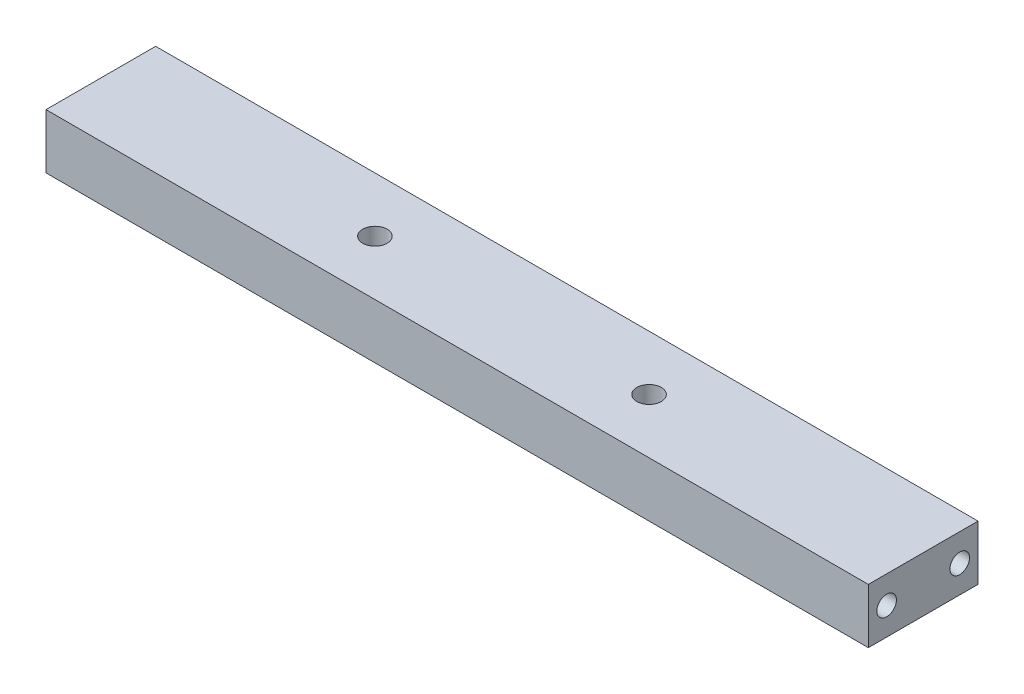
ISO-10303-21;
HEADER;
FILE_DESCRIPTION(('STEP AP214'),'2;1');
FILE_NAME('part.step','',(''),(''),'','','');
FILE_SCHEMA(('AUTOMOTIVE_DESIGN { 1 0 10303 214 1 1 1 1 }'));
ENDSEC;
DATA;
#1=APPLICATION_CONTEXT('core data for automotive mechanical design processes');
#2=APPLICATION_PROTOCOL_DEFINITION('international standard','automotive_design',2000,#1);
#3=PRODUCT_CONTEXT('',#1,'mechanical');
#4=PRODUCT('Part','Part','',(#3));
#5=PRODUCT_RELATED_PRODUCT_CATEGORY('part','',(#4));
#6=PRODUCT_DEFINITION_FORMATION('','',#4);
#7=PRODUCT_DEFINITION_CONTEXT('part definition',#1,'design');
#8=PRODUCT_DEFINITION('design','',#6,#7);
#9=PRODUCT_DEFINITION_SHAPE('','',#8);
#10=(LENGTH_UNIT() NAMED_UNIT(*) SI_UNIT(.MILLI.,.METRE.));
#11=(NAMED_UNIT(*) PLANE_ANGLE_UNIT() SI_UNIT($,.RADIAN.));
#12=(NAMED_UNIT(*) SI_UNIT($,.STERADIAN.) SOLID_ANGLE_UNIT());
#13=UNCERTAINTY_MEASURE_WITH_UNIT(LENGTH_MEASURE(1.E-05),#10,'distance_accuracy_value','');
#14=(GEOMETRIC_REPRESENTATION_CONTEXT(3) GLOBAL_UNCERTAINTY_ASSIGNED_CONTEXT((#13)) GLOBAL_UNIT_ASSIGNED_CONTEXT((#10,
#11,#12)) REPRESENTATION_CONTEXT('',''));
#15=CARTESIAN_POINT('',(0.,0.,0.));
#16=DIRECTION('',(0.,0.,1.));
#17=DIRECTION('',(1.,0.,0.));
#18=AXIS2_PLACEMENT_3D('',#15,#16,#17);
#19=CARTESIAN_POINT('',(142.875,9.525,19.05));
#20=DIRECTION('',(0.,0.,-1.));
#21=DIRECTION('',(0.,1.,0.));
#22=AXIS2_PLACEMENT_3D('',#19,#20,#21);
#23=PLANE('',#22);
#24=DIRECTION('',(0.,-1.,0.));
#25=VECTOR('',#24,1.);
#26=CARTESIAN_POINT('',(-142.875,9.525,19.05));
#27=LINE('',#26,#25);
#28=CARTESIAN_POINT('',(-142.875,9.525,19.05));
#29=VERTEX_POINT('',#28);
#30=CARTESIAN_POINT('',(-142.875,-9.525,19.05));
#31=VERTEX_POINT('',#30);
#32=EDGE_CURVE('E195',#29,#31,#27,.T.);
#33=ORIENTED_EDGE('',*,*,#32,.T.);
#34=DIRECTION('',(-1.,0.,0.));
#35=VECTOR('',#34,1.);
#36=CARTESIAN_POINT('',(142.875,-9.525,19.05));
#37=LINE('',#36,#35);
#38=CARTESIAN_POINT('',(142.875,-9.525,19.05));
#39=VERTEX_POINT('',#38);
#40=EDGE_CURVE('E11',#39,#31,#37,.T.);
#41=ORIENTED_EDGE('',*,*,#40,.F.);
#42=DIRECTION('',(0.,-1.,0.));
#43=VECTOR('',#42,1.);
#44=CARTESIAN_POINT('',(142.875,9.525,19.05));
#45=LINE('',#44,#43);
#46=CARTESIAN_POINT('',(142.875,9.525,19.05));
#47=VERTEX_POINT('',#46);
#48=EDGE_CURVE('E196',#47,#39,#45,.T.);
#49=ORIENTED_EDGE('',*,*,#48,.F.);
#50=DIRECTION('',(-1.,0.,0.));
#51=VECTOR('',#50,1.);
#52=CARTESIAN_POINT('',(142.875,9.525,19.05));
#53=LINE('',#52,#51);
#54=EDGE_CURVE('E202',#47,#29,#53,.T.);
#55=ORIENTED_EDGE('',*,*,#54,.T.);
#56=EDGE_LOOP('',(#33,#41,#49,#55));
#57=FACE_BOUND('',#56,.T.);
#58=ADVANCED_FACE('F36',(#57),#23,.F.);
#59=CARTESIAN_POINT('',(142.875,-9.525,19.05));
#60=DIRECTION('',(0.,1.,0.));
#61=DIRECTION('',(0.,0.,1.));
#62=AXIS2_PLACEMENT_3D('',#59,#60,#61);
#63=PLANE('',#62);
#64=CARTESIAN_POINT('',(19.05,-9.525,-12.7));
#65=DIRECTION('',(0.,-1.,0.));
#66=DIRECTION('',(0.,0.,-1.));
#67=AXIS2_PLACEMENT_3D('',#64,#65,#66);
#68=CIRCLE('',#67,2.1);
#69=CARTESIAN_POINT('',(19.05,-9.525,-14.8));
#70=VERTEX_POINT('',#69);
#71=EDGE_CURVE('E125',#70,#70,#68,.T.);
#72=ORIENTED_EDGE('',*,*,#71,.F.);
#73=EDGE_LOOP('',(#72));
#74=FACE_BOUND('',#73,.T.);
#75=CARTESIAN_POINT('',(-19.05,-9.525,-12.7));
#76=DIRECTION('',(0.,-1.,0.));
#77=DIRECTION('',(0.,0.,-1.));
#78=AXIS2_PLACEMENT_3D('',#75,#76,#77);
#79=CIRCLE('',#78,2.1);
#80=CARTESIAN_POINT('',(-19.05,-9.525,-14.8));
#81=VERTEX_POINT('',#80);
#82=EDGE_CURVE('E124',#81,#81,#79,.T.);
#83=ORIENTED_EDGE('',*,*,#82,.F.);
#84=EDGE_LOOP('',(#83));
#85=FACE_BOUND('',#84,.T.);
#86=CARTESIAN_POINT('',(-19.05,-9.525,12.7));
#87=DIRECTION('',(0.,-1.,0.));
#88=DIRECTION('',(0.,0.,-1.));
#89=AXIS2_PLACEMENT_3D('',#86,#87,#88);
#90=CIRCLE('',#89,2.1);
#91=CARTESIAN_POINT('',(-19.05,-9.525,10.6));
#92=VERTEX_POINT('',#91);
#93=EDGE_CURVE('E135',#92,#92,#90,.T.);
#94=ORIENTED_EDGE('',*,*,#93,.F.);
#95=EDGE_LOOP('',(#94));
#96=FACE_BOUND('',#95,.T.);
#97=CARTESIAN_POINT('',(19.05,-9.525,12.7));
#98=DIRECTION('',(0.,-1.,0.));
#99=DIRECTION('',(0.,0.,-1.));
#100=AXIS2_PLACEMENT_3D('',#97,#98,#99);
#101=CIRCLE('',#100,2.1);
#102=CARTESIAN_POINT('',(19.05,-9.525,10.6));
#103=VERTEX_POINT('',#102);
#104=EDGE_CURVE('E141',#103,#103,#101,.T.);
#105=ORIENTED_EDGE('',*,*,#104,.F.);
#106=EDGE_LOOP('',(#105));
#107=FACE_BOUND('',#106,.T.);
#108=CARTESIAN_POINT('',(-47.625,-9.525,0.));
#109=DIRECTION('',(0.,1.,0.));
#110=DIRECTION('',(0.,0.,1.));
#111=AXIS2_PLACEMENT_3D('',#108,#109,#110);
#112=CIRCLE('',#111,4.25);
#113=CARTESIAN_POINT('',(-47.625,-9.525,4.25));
#114=VERTEX_POINT('',#113);
#115=EDGE_CURVE('E162',#114,#114,#112,.T.);
#116=ORIENTED_EDGE('',*,*,#115,.T.);
#117=EDGE_LOOP('',(#116));
#118=FACE_BOUND('',#117,.T.);
#119=CARTESIAN_POINT('',(47.625,-9.525,0.));
#120=DIRECTION('',(0.,1.,0.));
#121=DIRECTION('',(0.,0.,1.));
#122=AXIS2_PLACEMENT_3D('',#119,#120,#121);
#123=CIRCLE('',#122,4.25);
#124=CARTESIAN_POINT('',(47.625,-9.525,4.25));
#125=VERTEX_POINT('',#124);
#126=EDGE_CURVE('E168',#125,#125,#123,.T.);
#127=ORIENTED_EDGE('',*,*,#126,.T.);
#128=EDGE_LOOP('',(#127));
#129=FACE_BOUND('',#128,.T.);
#130=DIRECTION('',(0.,0.,-1.));
#131=VECTOR('',#130,1.);
#132=CARTESIAN_POINT('',(-142.875,-9.525,19.05));
#133=LINE('',#132,#131);
#134=CARTESIAN_POINT('',(-142.875,-9.525,-19.05));
#135=VERTEX_POINT('',#134);
#136=EDGE_CURVE('E205',#31,#135,#133,.T.);
#137=ORIENTED_EDGE('',*,*,#136,.T.);
#138=DIRECTION('',(-1.,0.,0.));
#139=VECTOR('',#138,1.);
#140=CARTESIAN_POINT('',(142.875,-9.525,-19.05));
#141=LINE('',#140,#139);
#142=CARTESIAN_POINT('',(142.875,-9.525,-19.05));
#143=VERTEX_POINT('',#142);
#144=EDGE_CURVE('E44',#143,#135,#141,.T.);
#145=ORIENTED_EDGE('',*,*,#144,.F.);
#146=DIRECTION('',(0.,0.,-1.));
#147=VECTOR('',#146,1.);
#148=CARTESIAN_POINT('',(142.875,-9.525,19.05));
#149=LINE('',#148,#147);
#150=EDGE_CURVE('E83',#39,#143,#149,.T.);
#151=ORIENTED_EDGE('',*,*,#150,.F.);
#152=ORIENTED_EDGE('',*,*,#40,.T.);
#153=EDGE_LOOP('',(#137,#145,#151,#152));
#154=FACE_BOUND('',#153,.T.);
#155=ADVANCED_FACE('F230',(#74,#85,#96,#107,#118,#129,#154),#63,.F.);
#156=CARTESIAN_POINT('',(142.875,9.525,-19.05));
#157=DIRECTION('',(0.,0.,1.));
#158=DIRECTION('',(0.,-1.,0.));
#159=AXIS2_PLACEMENT_3D('',#156,#157,#158);
#160=PLANE('',#159);
#161=CARTESIAN_POINT('',(63.5,0.,-19.05));
#162=DIRECTION('',(0.,0.,-1.));
#163=DIRECTION('',(-1.,0.,0.));
#164=AXIS2_PLACEMENT_3D('',#161,#162,#163);
#165=CIRCLE('',#164,2.1);
#166=CARTESIAN_POINT('',(61.4,0.,-19.05));
#167=VERTEX_POINT('',#166);
#168=EDGE_CURVE('E147',#167,#167,#165,.T.);
#169=ORIENTED_EDGE('',*,*,#168,.F.);
#170=EDGE_LOOP('',(#169));
#171=FACE_BOUND('',#170,.T.);
#172=CARTESIAN_POINT('',(-63.5,0.,-19.05));
#173=DIRECTION('',(0.,0.,-1.));
#174=DIRECTION('',(-1.,0.,0.));
#175=AXIS2_PLACEMENT_3D('',#172,#173,#174);
#176=CIRCLE('',#175,2.1);
#177=CARTESIAN_POINT('',(-65.6,0.,-19.05));
#178=VERTEX_POINT('',#177);
#179=EDGE_CURVE('E153',#178,#178,#176,.T.);
#180=ORIENTED_EDGE('',*,*,#179,.F.);
#181=EDGE_LOOP('',(#180));
#182=FACE_BOUND('',#181,.T.);
#183=DIRECTION('',(0.,1.,0.));
#184=VECTOR('',#183,1.);
#185=CARTESIAN_POINT('',(-142.875,9.525,-19.05));
#186=LINE('',#185,#184);
#187=CARTESIAN_POINT('',(-142.875,9.525,-19.05));
#188=VERTEX_POINT('',#187);
#189=EDGE_CURVE('E70',#135,#188,#186,.T.);
#190=ORIENTED_EDGE('',*,*,#189,.T.);
#191=DIRECTION('',(-1.,0.,0.));
#192=VECTOR('',#191,1.);
#193=CARTESIAN_POINT('',(142.875,9.525,-19.05));
#194=LINE('',#193,#192);
#195=CARTESIAN_POINT('',(142.875,9.525,-19.05));
#196=VERTEX_POINT('',#195);
#197=EDGE_CURVE('E210',#196,#188,#194,.T.);
#198=ORIENTED_EDGE('',*,*,#197,.F.);
#199=DIRECTION('',(0.,1.,0.));
#200=VECTOR('',#199,1.);
#201=CARTESIAN_POINT('',(142.875,9.525,-19.05));
#202=LINE('',#201,#200);
#203=EDGE_CURVE('E199',#143,#196,#202,.T.);
#204=ORIENTED_EDGE('',*,*,#203,.F.);
#205=ORIENTED_EDGE('',*,*,#144,.T.);
#206=EDGE_LOOP('',(#190,#198,#204,#205));
#207=FACE_BOUND('',#206,.T.);
#208=ADVANCED_FACE('F212',(#171,#182,#207),#160,.F.);
#209=CARTESIAN_POINT('',(142.875,9.525,19.05));
#210=DIRECTION('',(0.,-1.,0.));
#211=DIRECTION('',(0.,0.,-1.));
#212=AXIS2_PLACEMENT_3D('',#209,#210,#211);
#213=PLANE('',#212);
#214=CARTESIAN_POINT('',(-47.625,9.525,0.));
#215=DIRECTION('',(0.,1.,0.));
#216=DIRECTION('',(0.,0.,1.));
#217=AXIS2_PLACEMENT_3D('',#214,#215,#216);
#218=CIRCLE('',#217,4.24999999999999);
#219=CARTESIAN_POINT('',(-47.625,9.525,4.24999999999999));
#220=VERTEX_POINT('',#219);
#221=EDGE_CURVE('E159',#220,#220,#218,.T.);
#222=ORIENTED_EDGE('',*,*,#221,.F.);
#223=EDGE_LOOP('',(#222));
#224=FACE_BOUND('',#223,.T.);
#225=CARTESIAN_POINT('',(47.625,9.525,0.));
#226=DIRECTION('',(0.,1.,0.));
#227=DIRECTION('',(0.,0.,1.));
#228=AXIS2_PLACEMENT_3D('',#225,#226,#227);
#229=CIRCLE('',#228,4.24999999999999);
#230=CARTESIAN_POINT('',(47.625,9.525,4.24999999999999));
#231=VERTEX_POINT('',#230);
#232=EDGE_CURVE('E165',#231,#231,#229,.T.);
#233=ORIENTED_EDGE('',*,*,#232,.F.);
#234=EDGE_LOOP('',(#233));
#235=FACE_BOUND('',#234,.T.);
#236=DIRECTION('',(0.,0.,1.));
#237=VECTOR('',#236,1.);
#238=CARTESIAN_POINT('',(-142.875,9.525,19.05));
#239=LINE('',#238,#237);
#240=EDGE_CURVE('E76',#188,#29,#239,.T.);
#241=ORIENTED_EDGE('',*,*,#240,.T.);
#242=ORIENTED_EDGE('',*,*,#54,.F.);
#243=DIRECTION('',(0.,0.,1.));
#244=VECTOR('',#243,1.);
#245=CARTESIAN_POINT('',(142.875,9.525,19.05));
#246=LINE('',#245,#244);
#247=EDGE_CURVE('E52',#196,#47,#246,.T.);
#248=ORIENTED_EDGE('',*,*,#247,.F.);
#249=ORIENTED_EDGE('',*,*,#197,.T.);
#250=EDGE_LOOP('',(#241,#242,#248,#249));
#251=FACE_BOUND('',#250,.T.);
#252=ADVANCED_FACE('F219',(#224,#235,#251),#213,.F.);
#253=CARTESIAN_POINT('',(142.875,9.525,19.05));
#254=DIRECTION('',(1.,0.,0.));
#255=DIRECTION('',(0.,0.,-1.));
#256=AXIS2_PLACEMENT_3D('',#253,#254,#255);
#257=PLANE('',#256);
#258=CARTESIAN_POINT('',(142.875,0.,12.7));
#259=DIRECTION('',(1.,0.,0.));
#260=DIRECTION('',(0.,0.,-1.));
#261=AXIS2_PLACEMENT_3D('',#258,#259,#260);
#262=CIRCLE('',#261,3.4);
#263=CARTESIAN_POINT('',(142.875,0.,9.3));
#264=VERTEX_POINT('',#263);
#265=EDGE_CURVE('E186',#264,#264,#262,.T.);
#266=ORIENTED_EDGE('',*,*,#265,.F.);
#267=EDGE_LOOP('',(#266));
#268=FACE_BOUND('',#267,.T.);
#269=CARTESIAN_POINT('',(142.875,0.,-12.7));
#270=DIRECTION('',(1.,0.,0.));
#271=DIRECTION('',(0.,0.,-1.));
#272=AXIS2_PLACEMENT_3D('',#269,#270,#271);
#273=CIRCLE('',#272,3.4);
#274=CARTESIAN_POINT('',(142.875,0.,-16.1));
#275=VERTEX_POINT('',#274);
#276=EDGE_CURVE('E192',#275,#275,#273,.T.);
#277=ORIENTED_EDGE('',*,*,#276,.F.);
#278=EDGE_LOOP('',(#277));
#279=FACE_BOUND('',#278,.T.);
#280=ORIENTED_EDGE('',*,*,#48,.T.);
#281=ORIENTED_EDGE('',*,*,#150,.T.);
#282=ORIENTED_EDGE('',*,*,#203,.T.);
#283=ORIENTED_EDGE('',*,*,#247,.T.);
#284=EDGE_LOOP('',(#280,#281,#282,#283));
#285=FACE_BOUND('',#284,.T.);
#286=ADVANCED_FACE('F221',(#268,#279,#285),#257,.T.);
#287=CARTESIAN_POINT('',(-142.875,9.525,19.05));
#288=DIRECTION('',(1.,0.,0.));
#289=DIRECTION('',(0.,0.,-1.));
#290=AXIS2_PLACEMENT_3D('',#287,#288,#289);
#291=PLANE('',#290);
#292=CARTESIAN_POINT('',(-142.875,0.,12.7));
#293=DIRECTION('',(-1.,0.,0.));
#294=DIRECTION('',(0.,0.,1.));
#295=AXIS2_PLACEMENT_3D('',#292,#293,#294);
#296=CIRCLE('',#295,3.4);
#297=CARTESIAN_POINT('',(-142.875,0.,16.1));
#298=VERTEX_POINT('',#297);
#299=EDGE_CURVE('E174',#298,#298,#296,.T.);
#300=ORIENTED_EDGE('',*,*,#299,.F.);
#301=EDGE_LOOP('',(#300));
#302=FACE_BOUND('',#301,.T.);
#303=CARTESIAN_POINT('',(-142.875,0.,-12.7));
#304=DIRECTION('',(-1.,0.,0.));
#305=DIRECTION('',(0.,0.,1.));
#306=AXIS2_PLACEMENT_3D('',#303,#304,#305);
#307=CIRCLE('',#306,3.4);
#308=CARTESIAN_POINT('',(-142.875,0.,-9.3));
#309=VERTEX_POINT('',#308);
#310=EDGE_CURVE('E180',#309,#309,#307,.T.);
#311=ORIENTED_EDGE('',*,*,#310,.F.);
#312=EDGE_LOOP('',(#311));
#313=FACE_BOUND('',#312,.T.);
#314=ORIENTED_EDGE('',*,*,#32,.F.);
#315=ORIENTED_EDGE('',*,*,#240,.F.);
#316=ORIENTED_EDGE('',*,*,#189,.F.);
#317=ORIENTED_EDGE('',*,*,#136,.F.);
#318=EDGE_LOOP('',(#314,#315,#316,#317));
#319=FACE_BOUND('',#318,.T.);
#320=ADVANCED_FACE('F215',(#302,#313,#319),#291,.F.);
#321=CARTESIAN_POINT('',(142.875,0.,-12.7));
#322=DIRECTION('',(1.,0.,0.));
#323=DIRECTION('',(0.,0.,-1.));
#324=AXIS2_PLACEMENT_3D('',#321,#322,#323);
#325=CYLINDRICAL_SURFACE('',#324,3.4);
#326=CARTESIAN_POINT('',(123.1138,0.,-12.7));
#327=DIRECTION('',(1.,0.,0.));
#328=DIRECTION('',(0.,0.,-1.));
#329=AXIS2_PLACEMENT_3D('',#326,#327,#328);
#330=CIRCLE('',#329,3.4);
#331=CARTESIAN_POINT('',(123.1138,0.,-16.1));
#332=VERTEX_POINT('',#331);
#333=EDGE_CURVE('E189',#332,#332,#330,.T.);
#334=ORIENTED_EDGE('',*,*,#333,.F.);
#335=EDGE_LOOP('',(#334));
#336=FACE_BOUND('',#335,.T.);
#337=ORIENTED_EDGE('',*,*,#276,.T.);
#338=EDGE_LOOP('',(#337));
#339=FACE_BOUND('',#338,.T.);
#340=ADVANCED_FACE('F296',(#336,#339),#325,.F.);
#341=CARTESIAN_POINT('',(123.1138,0.,-12.7));
#342=DIRECTION('',(1.,0.,0.));
#343=DIRECTION('',(0.,0.,-1.));
#344=AXIS2_PLACEMENT_3D('',#341,#342,#343);
#345=CONICAL_SURFACE('',#344,3.4,1.02974425867665);
#346=CARTESIAN_POINT('',(121.070873895306,0.,-12.7));
#347=VERTEX_POINT('',#346);
#348=VERTEX_LOOP('',#347);
#349=FACE_BOUND('',#348,.T.);
#350=ORIENTED_EDGE('',*,*,#333,.T.);
#351=EDGE_LOOP('',(#350));
#352=FACE_BOUND('',#351,.T.);
#353=ADVANCED_FACE('F292',(#349,#352),#345,.F.);
#354=CARTESIAN_POINT('',(142.875,0.,12.7));
#355=DIRECTION('',(1.,0.,0.));
#356=DIRECTION('',(0.,0.,-1.));
#357=AXIS2_PLACEMENT_3D('',#354,#355,#356);
#358=CYLINDRICAL_SURFACE('',#357,3.4);
#359=CARTESIAN_POINT('',(123.1138,0.,12.7));
#360=DIRECTION('',(1.,0.,0.));
#361=DIRECTION('',(0.,0.,-1.));
#362=AXIS2_PLACEMENT_3D('',#359,#360,#361);
#363=CIRCLE('',#362,3.4);
#364=CARTESIAN_POINT('',(123.1138,0.,9.3));
#365=VERTEX_POINT('',#364);
#366=EDGE_CURVE('E183',#365,#365,#363,.T.);
#367=ORIENTED_EDGE('',*,*,#366,.F.);
#368=EDGE_LOOP('',(#367));
#369=FACE_BOUND('',#368,.T.);
#370=ORIENTED_EDGE('',*,*,#265,.T.);
#371=EDGE_LOOP('',(#370));
#372=FACE_BOUND('',#371,.T.);
#373=ADVANCED_FACE('F288',(#369,#372),#358,.F.);
#374=CARTESIAN_POINT('',(123.1138,0.,12.7));
#375=DIRECTION('',(1.,0.,0.));
#376=DIRECTION('',(0.,0.,-1.));
#377=AXIS2_PLACEMENT_3D('',#374,#375,#376);
#378=CONICAL_SURFACE('',#377,3.4,1.02974425867665);
#379=CARTESIAN_POINT('',(121.070873895306,0.,12.7));
#380=VERTEX_POINT('',#379);
#381=VERTEX_LOOP('',#380);
#382=FACE_BOUND('',#381,.T.);
#383=ORIENTED_EDGE('',*,*,#366,.T.);
#384=EDGE_LOOP('',(#383));
#385=FACE_BOUND('',#384,.T.);
#386=ADVANCED_FACE('F284',(#382,#385),#378,.F.);
#387=CARTESIAN_POINT('',(-142.875,0.,-12.7));
#388=DIRECTION('',(-1.,0.,0.));
#389=DIRECTION('',(0.,0.,1.));
#390=AXIS2_PLACEMENT_3D('',#387,#388,#389);
#391=CYLINDRICAL_SURFACE('',#390,3.4);
#392=CARTESIAN_POINT('',(-123.1138,0.,-12.7));
#393=DIRECTION('',(-1.,0.,0.));
#394=DIRECTION('',(0.,0.,1.));
#395=AXIS2_PLACEMENT_3D('',#392,#393,#394);
#396=CIRCLE('',#395,3.4);
#397=CARTESIAN_POINT('',(-123.1138,0.,-9.3));
#398=VERTEX_POINT('',#397);
#399=EDGE_CURVE('E177',#398,#398,#396,.T.);
#400=ORIENTED_EDGE('',*,*,#399,.F.);
#401=EDGE_LOOP('',(#400));
#402=FACE_BOUND('',#401,.T.);
#403=ORIENTED_EDGE('',*,*,#310,.T.);
#404=EDGE_LOOP('',(#403));
#405=FACE_BOUND('',#404,.T.);
#406=ADVANCED_FACE('F280',(#402,#405),#391,.F.);
#407=CARTESIAN_POINT('',(-123.1138,0.,-12.7));
#408=DIRECTION('',(-1.,0.,0.));
#409=DIRECTION('',(0.,0.,1.));
#410=AXIS2_PLACEMENT_3D('',#407,#408,#409);
#411=CONICAL_SURFACE('',#410,3.4,1.02974425867665);
#412=CARTESIAN_POINT('',(-121.070873895306,0.,-12.7));
#413=VERTEX_POINT('',#412);
#414=VERTEX_LOOP('',#413);
#415=FACE_BOUND('',#414,.T.);
#416=ORIENTED_EDGE('',*,*,#399,.T.);
#417=EDGE_LOOP('',(#416));
#418=FACE_BOUND('',#417,.T.);
#419=ADVANCED_FACE('F276',(#415,#418),#411,.F.);
#420=CARTESIAN_POINT('',(-142.875,0.,12.7));
#421=DIRECTION('',(-1.,0.,0.));
#422=DIRECTION('',(0.,0.,1.));
#423=AXIS2_PLACEMENT_3D('',#420,#421,#422);
#424=CYLINDRICAL_SURFACE('',#423,3.4);
#425=CARTESIAN_POINT('',(-123.1138,0.,12.7));
#426=DIRECTION('',(-1.,0.,0.));
#427=DIRECTION('',(0.,0.,1.));
#428=AXIS2_PLACEMENT_3D('',#425,#426,#427);
#429=CIRCLE('',#428,3.4);
#430=CARTESIAN_POINT('',(-123.1138,0.,16.1));
#431=VERTEX_POINT('',#430);
#432=EDGE_CURVE('E171',#431,#431,#429,.T.);
#433=ORIENTED_EDGE('',*,*,#432,.F.);
#434=EDGE_LOOP('',(#433));
#435=FACE_BOUND('',#434,.T.);
#436=ORIENTED_EDGE('',*,*,#299,.T.);
#437=EDGE_LOOP('',(#436));
#438=FACE_BOUND('',#437,.T.);
#439=ADVANCED_FACE('F269',(#435,#438),#424,.F.);
#440=CARTESIAN_POINT('',(-123.1138,0.,12.7));
#441=DIRECTION('',(-1.,0.,0.));
#442=DIRECTION('',(0.,0.,1.));
#443=AXIS2_PLACEMENT_3D('',#440,#441,#442);
#444=CONICAL_SURFACE('',#443,3.4,1.02974425867665);
#445=CARTESIAN_POINT('',(-121.070873895306,0.,12.7));
#446=VERTEX_POINT('',#445);
#447=VERTEX_LOOP('',#446);
#448=FACE_BOUND('',#447,.T.);
#449=ORIENTED_EDGE('',*,*,#432,.T.);
#450=EDGE_LOOP('',(#449));
#451=FACE_BOUND('',#450,.T.);
#452=ADVANCED_FACE('F259',(#448,#451),#444,.F.);
#453=CARTESIAN_POINT('',(47.625,9.525,0.));
#454=DIRECTION('',(0.,1.,0.));
#455=DIRECTION('',(0.,0.,1.));
#456=AXIS2_PLACEMENT_3D('',#453,#454,#455);
#457=CYLINDRICAL_SURFACE('',#456,4.24999999999999);
#458=ORIENTED_EDGE('',*,*,#126,.F.);
#459=EDGE_LOOP('',(#458));
#460=FACE_BOUND('',#459,.T.);
#461=ORIENTED_EDGE('',*,*,#232,.T.);
#462=EDGE_LOOP('',(#461));
#463=FACE_BOUND('',#462,.T.);
#464=ADVANCED_FACE('F255',(#460,#463),#457,.F.);
#465=CARTESIAN_POINT('',(-47.625,9.525,0.));
#466=DIRECTION('',(0.,1.,0.));
#467=DIRECTION('',(0.,0.,1.));
#468=AXIS2_PLACEMENT_3D('',#465,#466,#467);
#469=CYLINDRICAL_SURFACE('',#468,4.24999999999999);
#470=ORIENTED_EDGE('',*,*,#115,.F.);
#471=EDGE_LOOP('',(#470));
#472=FACE_BOUND('',#471,.T.);
#473=ORIENTED_EDGE('',*,*,#221,.T.);
#474=EDGE_LOOP('',(#473));
#475=FACE_BOUND('',#474,.T.);
#476=ADVANCED_FACE('F258',(#472,#475),#469,.F.);
#477=CARTESIAN_POINT('',(-63.5,0.,-6.6548));
#478=DIRECTION('',(0.,0.,-1.));
#479=DIRECTION('',(-1.,0.,0.));
#480=AXIS2_PLACEMENT_3D('',#477,#478,#479);
#481=CONICAL_SURFACE('',#480,2.1,1.02974425867665);
#482=CARTESIAN_POINT('',(-63.5,0.,-5.39299270004213));
#483=VERTEX_POINT('',#482);
#484=VERTEX_LOOP('',#483);
#485=FACE_BOUND('',#484,.T.);
#486=CARTESIAN_POINT('',(-63.5,0.,-6.6548));
#487=DIRECTION('',(0.,0.,-1.));
#488=DIRECTION('',(-1.,0.,0.));
#489=AXIS2_PLACEMENT_3D('',#486,#487,#488);
#490=CIRCLE('',#489,2.1);
#491=CARTESIAN_POINT('',(-65.6,0.,-6.6548));
#492=VERTEX_POINT('',#491);
#493=EDGE_CURVE('E156',#492,#492,#490,.T.);
#494=ORIENTED_EDGE('',*,*,#493,.T.);
#495=EDGE_LOOP('',(#494));
#496=FACE_BOUND('',#495,.T.);
#497=ADVANCED_FACE('F266',(#485,#496),#481,.F.);
#498=CARTESIAN_POINT('',(-63.5,0.,-19.05));
#499=DIRECTION('',(0.,0.,-1.));
#500=DIRECTION('',(-1.,0.,0.));
#501=AXIS2_PLACEMENT_3D('',#498,#499,#500);
#502=CYLINDRICAL_SURFACE('',#501,2.1);
#503=ORIENTED_EDGE('',*,*,#493,.F.);
#504=EDGE_LOOP('',(#503));
#505=FACE_BOUND('',#504,.T.);
#506=ORIENTED_EDGE('',*,*,#179,.T.);
#507=EDGE_LOOP('',(#506));
#508=FACE_BOUND('',#507,.T.);
#509=ADVANCED_FACE('F381',(#505,#508),#502,.F.);
#510=CARTESIAN_POINT('',(63.5,0.,-6.6548));
#511=DIRECTION('',(0.,0.,-1.));
#512=DIRECTION('',(-1.,0.,0.));
#513=AXIS2_PLACEMENT_3D('',#510,#511,#512);
#514=CONICAL_SURFACE('',#513,2.09999999999999,1.02974425867665);
#515=CARTESIAN_POINT('',(63.5,0.,-5.39299270004213));
#516=VERTEX_POINT('',#515);
#517=VERTEX_LOOP('',#516);
#518=FACE_BOUND('',#517,.T.);
#519=CARTESIAN_POINT('',(63.5,0.,-6.6548));
#520=DIRECTION('',(0.,0.,-1.));
#521=DIRECTION('',(-1.,0.,0.));
#522=AXIS2_PLACEMENT_3D('',#519,#520,#521);
#523=CIRCLE('',#522,2.09999999999999);
#524=CARTESIAN_POINT('',(61.4,0.,-6.6548));
#525=VERTEX_POINT('',#524);
#526=EDGE_CURVE('E150',#525,#525,#523,.T.);
#527=ORIENTED_EDGE('',*,*,#526,.T.);
#528=EDGE_LOOP('',(#527));
#529=FACE_BOUND('',#528,.T.);
#530=ADVANCED_FACE('F391',(#518,#529),#514,.F.);
#531=CARTESIAN_POINT('',(63.5,0.,-19.05));
#532=DIRECTION('',(0.,0.,-1.));
#533=DIRECTION('',(-1.,0.,0.));
#534=AXIS2_PLACEMENT_3D('',#531,#532,#533);
#535=CYLINDRICAL_SURFACE('',#534,2.1);
#536=ORIENTED_EDGE('',*,*,#526,.F.);
#537=EDGE_LOOP('',(#536));
#538=FACE_BOUND('',#537,.T.);
#539=ORIENTED_EDGE('',*,*,#168,.T.);
#540=EDGE_LOOP('',(#539));
#541=FACE_BOUND('',#540,.T.);
#542=ADVANCED_FACE('F402',(#538,#541),#535,.F.);
#543=CARTESIAN_POINT('',(19.05,2.8702,12.7));
#544=DIRECTION('',(0.,-1.,0.));
#545=DIRECTION('',(0.,0.,-1.));
#546=AXIS2_PLACEMENT_3D('',#543,#544,#545);
#547=CONICAL_SURFACE('',#546,2.1,1.02974425867665);
#548=CARTESIAN_POINT('',(19.05,4.13200729995787,12.7));
#549=VERTEX_POINT('',#548);
#550=VERTEX_LOOP('',#549);
#551=FACE_BOUND('',#550,.T.);
#552=CARTESIAN_POINT('',(19.05,2.8702,12.7));
#553=DIRECTION('',(0.,-1.,0.));
#554=DIRECTION('',(0.,0.,-1.));
#555=AXIS2_PLACEMENT_3D('',#552,#553,#554);
#556=CIRCLE('',#555,2.1);
#557=CARTESIAN_POINT('',(19.05,2.8702,10.6));
#558=VERTEX_POINT('',#557);
#559=EDGE_CURVE('E144',#558,#558,#556,.T.);
#560=ORIENTED_EDGE('',*,*,#559,.T.);
#561=EDGE_LOOP('',(#560));
#562=FACE_BOUND('',#561,.T.);
#563=ADVANCED_FACE('F411',(#551,#562),#547,.F.);
#564=CARTESIAN_POINT('',(19.05,-9.525,12.7));
#565=DIRECTION('',(0.,-1.,0.));
#566=DIRECTION('',(0.,0.,-1.));
#567=AXIS2_PLACEMENT_3D('',#564,#565,#566);
#568=CYLINDRICAL_SURFACE('',#567,2.1);
#569=ORIENTED_EDGE('',*,*,#559,.F.);
#570=EDGE_LOOP('',(#569));
#571=FACE_BOUND('',#570,.T.);
#572=ORIENTED_EDGE('',*,*,#104,.T.);
#573=EDGE_LOOP('',(#572));
#574=FACE_BOUND('',#573,.T.);
#575=ADVANCED_FACE('F427',(#571,#574),#568,.F.);
#576=CARTESIAN_POINT('',(-19.05,2.8702,12.7));
#577=DIRECTION('',(0.,-1.,0.));
#578=DIRECTION('',(0.,0.,-1.));
#579=AXIS2_PLACEMENT_3D('',#576,#577,#578);
#580=CONICAL_SURFACE('',#579,2.1,1.02974425867665);
#581=CARTESIAN_POINT('',(-19.05,4.13200729995787,12.7));
#582=VERTEX_POINT('',#581);
#583=VERTEX_LOOP('',#582);
#584=FACE_BOUND('',#583,.T.);
#585=CARTESIAN_POINT('',(-19.05,2.8702,12.7));
#586=DIRECTION('',(0.,-1.,0.));
#587=DIRECTION('',(0.,0.,-1.));
#588=AXIS2_PLACEMENT_3D('',#585,#586,#587);
#589=CIRCLE('',#588,2.1);
#590=CARTESIAN_POINT('',(-19.05,2.8702,10.6));
#591=VERTEX_POINT('',#590);
#592=EDGE_CURVE('E138',#591,#591,#589,.T.);
#593=ORIENTED_EDGE('',*,*,#592,.T.);
#594=EDGE_LOOP('',(#593));
#595=FACE_BOUND('',#594,.T.);
#596=ADVANCED_FACE('F438',(#584,#595),#580,.F.);
#597=CARTESIAN_POINT('',(-19.05,-9.525,12.7));
#598=DIRECTION('',(0.,-1.,0.));
#599=DIRECTION('',(0.,0.,-1.));
#600=AXIS2_PLACEMENT_3D('',#597,#598,#599);
#601=CYLINDRICAL_SURFACE('',#600,2.1);
#602=ORIENTED_EDGE('',*,*,#592,.F.);
#603=EDGE_LOOP('',(#602));
#604=FACE_BOUND('',#603,.T.);
#605=ORIENTED_EDGE('',*,*,#93,.T.);
#606=EDGE_LOOP('',(#605));
#607=FACE_BOUND('',#606,.T.);
#608=ADVANCED_FACE('F450',(#604,#607),#601,.F.);
#609=CARTESIAN_POINT('',(-19.05,2.8702,-12.7));
#610=DIRECTION('',(0.,-1.,0.));
#611=DIRECTION('',(0.,0.,-1.));
#612=AXIS2_PLACEMENT_3D('',#609,#610,#611);
#613=CONICAL_SURFACE('',#612,2.1,1.02974425867665);
#614=CARTESIAN_POINT('',(-19.05,4.13200729995787,-12.7));
#615=VERTEX_POINT('',#614);
#616=VERTEX_LOOP('',#615);
#617=FACE_BOUND('',#616,.T.);
#618=CARTESIAN_POINT('',(-19.05,2.8702,-12.7));
#619=DIRECTION('',(0.,-1.,0.));
#620=DIRECTION('',(0.,0.,-1.));
#621=AXIS2_PLACEMENT_3D('',#618,#619,#620);
#622=CIRCLE('',#621,2.1);
#623=CARTESIAN_POINT('',(-19.05,2.8702,-14.8));
#624=VERTEX_POINT('',#623);
#625=EDGE_CURVE('E128',#624,#624,#622,.T.);
#626=ORIENTED_EDGE('',*,*,#625,.T.);
#627=EDGE_LOOP('',(#626));
#628=FACE_BOUND('',#627,.T.);
#629=ADVANCED_FACE('F460',(#617,#628),#613,.F.);
#630=CARTESIAN_POINT('',(-19.05,-9.525,-12.7));
#631=DIRECTION('',(0.,-1.,0.));
#632=DIRECTION('',(0.,0.,-1.));
#633=AXIS2_PLACEMENT_3D('',#630,#631,#632);
#634=CYLINDRICAL_SURFACE('',#633,2.1);
#635=ORIENTED_EDGE('',*,*,#625,.F.);
#636=EDGE_LOOP('',(#635));
#637=FACE_BOUND('',#636,.T.);
#638=ORIENTED_EDGE('',*,*,#82,.T.);
#639=EDGE_LOOP('',(#638));
#640=FACE_BOUND('',#639,.T.);
#641=ADVANCED_FACE('F118',(#637,#640),#634,.F.);
#642=CARTESIAN_POINT('',(19.05,2.8702,-12.7));
#643=DIRECTION('',(0.,-1.,0.));
#644=DIRECTION('',(0.,0.,-1.));
#645=AXIS2_PLACEMENT_3D('',#642,#643,#644);
#646=CONICAL_SURFACE('',#645,2.1,1.02974425867665);
#647=CARTESIAN_POINT('',(19.05,4.13200729995787,-12.7));
#648=VERTEX_POINT('',#647);
#649=VERTEX_LOOP('',#648);
#650=FACE_BOUND('',#649,.T.);
#651=CARTESIAN_POINT('',(19.05,2.8702,-12.7));
#652=DIRECTION('',(0.,-1.,0.));
#653=DIRECTION('',(0.,0.,-1.));
#654=AXIS2_PLACEMENT_3D('',#651,#652,#653);
#655=CIRCLE('',#654,2.1);
#656=CARTESIAN_POINT('',(19.05,2.8702,-14.8));
#657=VERTEX_POINT('',#656);
#658=EDGE_CURVE('E122',#657,#657,#655,.T.);
#659=ORIENTED_EDGE('',*,*,#658,.T.);
#660=EDGE_LOOP('',(#659));
#661=FACE_BOUND('',#660,.T.);
#662=ADVANCED_FACE('F114',(#650,#661),#646,.F.);
#663=CARTESIAN_POINT('',(19.05,-9.525,-12.7));
#664=DIRECTION('',(0.,-1.,0.));
#665=DIRECTION('',(0.,0.,-1.));
#666=AXIS2_PLACEMENT_3D('',#663,#664,#665);
#667=CYLINDRICAL_SURFACE('',#666,2.1);
#668=ORIENTED_EDGE('',*,*,#658,.F.);
#669=EDGE_LOOP('',(#668));
#670=FACE_BOUND('',#669,.T.);
#671=ORIENTED_EDGE('',*,*,#71,.T.);
#672=EDGE_LOOP('',(#671));
#673=FACE_BOUND('',#672,.T.);
#674=ADVANCED_FACE('F117',(#670,#673),#667,.F.);
#675=CLOSED_SHELL('',(#58,#155,#208,#252,#286,#320,#340,#353,#373,#386,#406,#419,#439,#452,#464,
#476,#497,#509,#530,#542,#563,#575,#596,#608,#629,#641,#662,#674));
#676=MANIFOLD_SOLID_BREP('B2',#675);
#677=ADVANCED_BREP_SHAPE_REPRESENTATION('',(#18,#676),#14);
#678=SHAPE_DEFINITION_REPRESENTATION(#9,#677);
ENDSEC;
END-ISO-10303-21;
